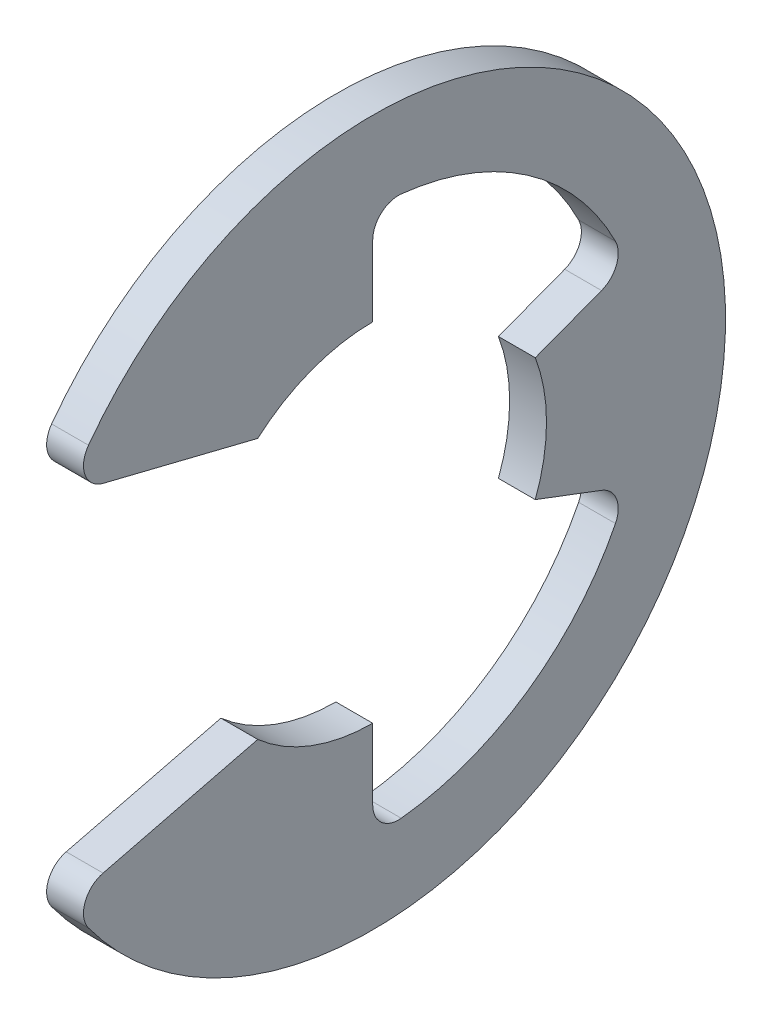
ISO-10303-21;
HEADER;
FILE_DESCRIPTION(('STEP AP214'),'2;1');
FILE_NAME('part.step','',(''),(''),'','','');
FILE_SCHEMA(('AUTOMOTIVE_DESIGN { 1 0 10303 214 1 1 1 1 }'));
ENDSEC;
DATA;
#1=APPLICATION_CONTEXT('core data for automotive mechanical design processes');
#2=APPLICATION_PROTOCOL_DEFINITION('international standard','automotive_design',2000,#1);
#3=PRODUCT_CONTEXT('',#1,'mechanical');
#4=PRODUCT('Part','Part','',(#3));
#5=PRODUCT_RELATED_PRODUCT_CATEGORY('part','',(#4));
#6=PRODUCT_DEFINITION_FORMATION('','',#4);
#7=PRODUCT_DEFINITION_CONTEXT('part definition',#1,'design');
#8=PRODUCT_DEFINITION('design','',#6,#7);
#9=PRODUCT_DEFINITION_SHAPE('','',#8);
#10=(LENGTH_UNIT() NAMED_UNIT(*) SI_UNIT(.MILLI.,.METRE.));
#11=(NAMED_UNIT(*) PLANE_ANGLE_UNIT() SI_UNIT($,.RADIAN.));
#12=(NAMED_UNIT(*) SI_UNIT($,.STERADIAN.) SOLID_ANGLE_UNIT());
#13=UNCERTAINTY_MEASURE_WITH_UNIT(LENGTH_MEASURE(1.E-05),#10,'distance_accuracy_value','');
#14=(GEOMETRIC_REPRESENTATION_CONTEXT(3) GLOBAL_UNCERTAINTY_ASSIGNED_CONTEXT((#13)) GLOBAL_UNIT_ASSIGNED_CONTEXT((#10,
#11,#12)) REPRESENTATION_CONTEXT('',''));
#15=CARTESIAN_POINT('',(0.,0.,0.));
#16=DIRECTION('',(0.,0.,1.));
#17=DIRECTION('',(1.,0.,0.));
#18=AXIS2_PLACEMENT_3D('',#15,#16,#17);
#19=CARTESIAN_POINT('',(-0.5334,0.,0.));
#20=DIRECTION('',(1.,0.,0.));
#21=DIRECTION('',(0.,0.,-1.));
#22=AXIS2_PLACEMENT_3D('',#19,#20,#21);
#23=PLANE('',#22);
#24=CARTESIAN_POINT('',(-0.5334,0.,0.));
#25=DIRECTION('',(-1.,0.,0.));
#26=DIRECTION('',(0.,0.,1.));
#27=AXIS2_PLACEMENT_3D('',#24,#25,#26);
#28=CIRCLE('',#27,10.2108);
#29=CARTESIAN_POINT('',(-0.533400000146,-6.05063164709256,8.22497983652338));
#30=VERTEX_POINT('',#29);
#31=CARTESIAN_POINT('',(-0.5334,6.05063164709256,8.22497983652338));
#32=VERTEX_POINT('',#31);
#33=EDGE_CURVE('E139',#30,#32,#28,.F.);
#34=ORIENTED_EDGE('',*,*,#33,.F.);
#35=CARTESIAN_POINT('',(-0.533400000146,-5.60812276544,7.62345146042));
#36=DIRECTION('',(-1.,0.,0.));
#37=DIRECTION('',(0.,0.,1.));
#38=AXIS2_PLACEMENT_3D('',#35,#36,#37);
#39=CIRCLE('',#38,0.74676);
#40=CARTESIAN_POINT('',(-0.533400000146,-4.88336468230544,7.80338538866378));
#41=VERTEX_POINT('',#40);
#42=EDGE_CURVE('E20',#41,#30,#39,.F.);
#43=ORIENTED_EDGE('',*,*,#42,.F.);
#44=DIRECTION('',(0.,0.24095282060708,-0.970536829925322));
#45=VECTOR('',#44,1.);
#46=CARTESIAN_POINT('',(-0.533400000146,-5.13688856516,8.82455735485));
#47=LINE('',#46,#45);
#48=CARTESIAN_POINT('',(-0.533400000146,-3.77189999999897,3.32650312340268));
#49=VERTEX_POINT('',#48);
#50=EDGE_CURVE('E143',#41,#49,#47,.T.);
#51=ORIENTED_EDGE('',*,*,#50,.T.);
#52=CARTESIAN_POINT('',(-0.533400000146,0.,0.));
#53=DIRECTION('',(-1.,0.,0.));
#54=DIRECTION('',(0.,0.,1.));
#55=AXIS2_PLACEMENT_3D('',#52,#53,#54);
#56=CIRCLE('',#55,5.0292);
#57=CARTESIAN_POINT('',(-0.533400000146,-5.0292,0.));
#58=VERTEX_POINT('',#57);
#59=EDGE_CURVE('E218',#49,#58,#56,.F.);
#60=ORIENTED_EDGE('',*,*,#59,.T.);
#61=DIRECTION('',(0.,-1.,0.));
#62=VECTOR('',#61,1.);
#63=CARTESIAN_POINT('',(-0.533400000146,-5.0292,0.));
#64=LINE('',#63,#62);
#65=CARTESIAN_POINT('',(-0.533400000146,-7.07977202237,0.));
#66=VERTEX_POINT('',#65);
#67=EDGE_CURVE('E165',#58,#66,#64,.T.);
#68=ORIENTED_EDGE('',*,*,#67,.T.);
#69=CARTESIAN_POINT('',(-0.533400000146,-7.07977202194,-0.74676));
#70=DIRECTION('',(-1.,0.,0.));
#71=DIRECTION('',(0.,0.,1.));
#72=AXIS2_PLACEMENT_3D('',#69,#70,#71);
#73=CIRCLE('',#72,0.74676);
#74=CARTESIAN_POINT('',(-0.533400000146,-7.82241228858765,-0.825092189765818));
#75=VERTEX_POINT('',#74);
#76=EDGE_CURVE('E220',#66,#75,#73,.F.);
#77=ORIENTED_EDGE('',*,*,#76,.T.);
#78=CARTESIAN_POINT('',(-0.533400000146,0.,0.));
#79=DIRECTION('',(-1.,0.,0.));
#80=DIRECTION('',(0.,0.,1.));
#81=AXIS2_PLACEMENT_3D('',#78,#79,#80);
#82=CIRCLE('',#81,7.86580645161);
#83=CARTESIAN_POINT('',(-0.533400000146,-3.5374434588992,-7.02548253924918));
#84=VERTEX_POINT('',#83);
#85=EDGE_CURVE('E222',#75,#84,#82,.F.);
#86=ORIENTED_EDGE('',*,*,#85,.T.);
#87=CARTESIAN_POINT('',(-0.533400000146,-3.20160742052,-6.35850079068));
#88=DIRECTION('',(-1.,0.,0.));
#89=DIRECTION('',(0.,0.,1.));
#90=AXIS2_PLACEMENT_3D('',#87,#88,#89);
#91=CIRCLE('',#90,0.74676);
#92=CARTESIAN_POINT('',(-0.533400000073,-2.50307740313384,-6.62252032104072));
#93=VERTEX_POINT('',#92);
#94=EDGE_CURVE('E226',#84,#93,#91,.F.);
#95=ORIENTED_EDGE('',*,*,#94,.T.);
#96=DIRECTION('',(0.,0.353553390593195,0.935414346693515));
#97=VECTOR('',#96,1.);
#98=CARTESIAN_POINT('',(-0.533400000146001,-1.77809071197,-4.70438583239));
#99=LINE('',#98,#97);
#100=CARTESIAN_POINT('',(-0.533400000146,-1.77809071197025,-4.70438583239066));
#101=VERTEX_POINT('',#100);
#102=EDGE_CURVE('E169',#93,#101,#99,.T.);
#103=ORIENTED_EDGE('',*,*,#102,.T.);
#104=CARTESIAN_POINT('',(-0.533400000146,0.,0.));
#105=DIRECTION('',(-1.,0.,0.));
#106=DIRECTION('',(0.,0.,1.));
#107=AXIS2_PLACEMENT_3D('',#104,#105,#106);
#108=CIRCLE('',#107,5.0292);
#109=CARTESIAN_POINT('',(-0.533400000073,1.7780907119705,-4.70438583239133));
#110=VERTEX_POINT('',#109);
#111=EDGE_CURVE('E228',#101,#110,#108,.F.);
#112=ORIENTED_EDGE('',*,*,#111,.T.);
#113=DIRECTION('',(0.,0.353553390593195,-0.935414346693515));
#114=VECTOR('',#113,1.);
#115=CARTESIAN_POINT('',(-0.533400000146001,1.77809071197,-4.70438583239));
#116=LINE('',#115,#114);
#117=CARTESIAN_POINT('',(-0.533400000146,2.50307740313355,-6.62252032104083));
#118=VERTEX_POINT('',#117);
#119=EDGE_CURVE('E174',#110,#118,#116,.T.);
#120=ORIENTED_EDGE('',*,*,#119,.T.);
#121=CARTESIAN_POINT('',(-0.533400000146,3.20160742052,-6.35850079068));
#122=DIRECTION('',(-1.,0.,0.));
#123=DIRECTION('',(0.,0.,1.));
#124=AXIS2_PLACEMENT_3D('',#121,#122,#123);
#125=CIRCLE('',#124,0.74676);
#126=CARTESIAN_POINT('',(-0.533400000065342,3.53744345889961,-7.02548253925));
#127=VERTEX_POINT('',#126);
#128=EDGE_CURVE('E177',#118,#127,#125,.F.);
#129=ORIENTED_EDGE('',*,*,#128,.T.);
#130=CARTESIAN_POINT('',(-0.533400000146,0.,0.));
#131=DIRECTION('',(-1.,0.,0.));
#132=DIRECTION('',(0.,0.,1.));
#133=AXIS2_PLACEMENT_3D('',#130,#131,#132);
#134=CIRCLE('',#133,7.86580645161);
#135=CARTESIAN_POINT('',(-0.533400000146,7.82241228858322,-0.825092189765351));
#136=VERTEX_POINT('',#135);
#137=EDGE_CURVE('E233',#127,#136,#134,.F.);
#138=ORIENTED_EDGE('',*,*,#137,.T.);
#139=CARTESIAN_POINT('',(-0.533400000146,7.07977202194,-0.74676));
#140=DIRECTION('',(-1.,0.,0.));
#141=DIRECTION('',(0.,0.,1.));
#142=AXIS2_PLACEMENT_3D('',#139,#140,#141);
#143=CIRCLE('',#142,0.74676);
#144=CARTESIAN_POINT('',(-0.533400000146,7.07977202194,0.));
#145=VERTEX_POINT('',#144);
#146=EDGE_CURVE('E181',#136,#145,#143,.F.);
#147=ORIENTED_EDGE('',*,*,#146,.T.);
#148=DIRECTION('',(0.,-1.,0.));
#149=VECTOR('',#148,1.);
#150=CARTESIAN_POINT('',(-0.533400000146,5.0292,0.));
#151=LINE('',#150,#149);
#152=CARTESIAN_POINT('',(-0.533400000146,5.0292,0.));
#153=VERTEX_POINT('',#152);
#154=EDGE_CURVE('E178',#145,#153,#151,.T.);
#155=ORIENTED_EDGE('',*,*,#154,.T.);
#156=CARTESIAN_POINT('',(-0.533400000146,0.,0.));
#157=DIRECTION('',(-1.,0.,0.));
#158=DIRECTION('',(0.,0.,1.));
#159=AXIS2_PLACEMENT_3D('',#156,#157,#158);
#160=CIRCLE('',#159,5.0292);
#161=CARTESIAN_POINT('',(-0.533400000146,3.77190000000918,3.3265031233911));
#162=VERTEX_POINT('',#161);
#163=EDGE_CURVE('E238',#153,#162,#160,.F.);
#164=ORIENTED_EDGE('',*,*,#163,.T.);
#165=DIRECTION('',(0.,0.24095282060708,0.970536829925322));
#166=VECTOR('',#165,1.);
#167=CARTESIAN_POINT('',(-0.533400000146,5.13688856516,8.82455735485));
#168=LINE('',#167,#166);
#169=CARTESIAN_POINT('',(-0.533400000146,4.88336468232247,7.80338538873828));
#170=VERTEX_POINT('',#169);
#171=EDGE_CURVE('E183',#162,#170,#168,.T.);
#172=ORIENTED_EDGE('',*,*,#171,.T.);
#173=CARTESIAN_POINT('',(-0.533400000146,5.60812276544,7.62345146042));
#174=DIRECTION('',(-1.,0.,0.));
#175=DIRECTION('',(0.,0.,1.));
#176=AXIS2_PLACEMENT_3D('',#173,#174,#175);
#177=CIRCLE('',#176,0.74676);
#178=EDGE_CURVE('E185',#32,#170,#177,.F.);
#179=ORIENTED_EDGE('',*,*,#178,.F.);
#180=EDGE_LOOP('',(#34,#43,#51,#60,#68,#77,#86,#95,#103,#112,#120,#129,#138,#147,#155,#164,#172,#179));
#181=FACE_BOUND('',#180,.T.);
#182=ADVANCED_FACE('F17',(#181),#23,.F.);
#183=CARTESIAN_POINT('',(0.5334,-5.13688856516,8.82455735485));
#184=DIRECTION('',(0.,-0.970536829925322,-0.24095282060708));
#185=DIRECTION('',(0.,0.24095282060708,-0.970536829925322));
#186=AXIS2_PLACEMENT_3D('',#183,#184,#185);
#187=PLANE('',#186);
#188=DIRECTION('',(-1.,0.,0.));
#189=VECTOR('',#188,1.);
#190=CARTESIAN_POINT('',(0.5334,-4.88336468228867,7.80338538859033));
#191=LINE('',#190,#189);
#192=CARTESIAN_POINT('',(0.5334,-4.88336468230749,7.8033853886633));
#193=VERTEX_POINT('',#192);
#194=EDGE_CURVE('E150',#193,#41,#191,.T.);
#195=ORIENTED_EDGE('',*,*,#194,.F.);
#196=DIRECTION('',(0.,-0.240952820607153,0.970536829925303));
#197=VECTOR('',#196,1.);
#198=CARTESIAN_POINT('',(0.5334,-3.7719,3.3265031234));
#199=LINE('',#198,#197);
#200=CARTESIAN_POINT('',(0.5334,-3.77190000000052,3.32650312340092));
#201=VERTEX_POINT('',#200);
#202=EDGE_CURVE('E217',#201,#193,#199,.T.);
#203=ORIENTED_EDGE('',*,*,#202,.F.);
#204=DIRECTION('',(-1.,0.,0.));
#205=VECTOR('',#204,1.);
#206=CARTESIAN_POINT('',(0.5334,-3.77190000000075,3.32650312340066));
#207=LINE('',#206,#205);
#208=EDGE_CURVE('E155',#201,#49,#207,.T.);
#209=ORIENTED_EDGE('',*,*,#208,.T.);
#210=ORIENTED_EDGE('',*,*,#50,.F.);
#211=EDGE_LOOP('',(#195,#203,#209,#210));
#212=FACE_BOUND('',#211,.T.);
#213=ADVANCED_FACE('F152',(#212),#187,.F.);
#214=CARTESIAN_POINT('',(0.5334,-5.60812276544,7.62345146042));
#215=DIRECTION('',(-1.,0.,0.));
#216=DIRECTION('',(0.,0.,1.));
#217=AXIS2_PLACEMENT_3D('',#214,#215,#216);
#218=CYLINDRICAL_SURFACE('',#217,0.74676);
#219=ORIENTED_EDGE('',*,*,#42,.T.);
#220=DIRECTION('',(-1.,0.,0.));
#221=VECTOR('',#220,1.);
#222=CARTESIAN_POINT('',(0.5334,-6.05063164709211,8.22497983652285));
#223=LINE('',#222,#221);
#224=CARTESIAN_POINT('',(0.5334,-6.05063164709215,8.22497983652282));
#225=VERTEX_POINT('',#224);
#226=EDGE_CURVE('E149',#225,#30,#223,.T.);
#227=ORIENTED_EDGE('',*,*,#226,.F.);
#228=CARTESIAN_POINT('',(0.5334,-5.60812276544,7.62345146042));
#229=DIRECTION('',(-1.,0.,0.));
#230=DIRECTION('',(0.,0.,1.));
#231=AXIS2_PLACEMENT_3D('',#228,#229,#230);
#232=CIRCLE('',#231,0.74676);
#233=EDGE_CURVE('E159',#193,#225,#232,.F.);
#234=ORIENTED_EDGE('',*,*,#233,.F.);
#235=ORIENTED_EDGE('',*,*,#194,.T.);
#236=EDGE_LOOP('',(#219,#227,#234,#235));
#237=FACE_BOUND('',#236,.T.);
#238=ADVANCED_FACE('F158',(#237),#218,.T.);
#239=CARTESIAN_POINT('',(0.5334,0.,0.));
#240=DIRECTION('',(-1.,0.,0.));
#241=DIRECTION('',(0.,0.,1.));
#242=AXIS2_PLACEMENT_3D('',#239,#240,#241);
#243=CYLINDRICAL_SURFACE('',#242,10.2108);
#244=DIRECTION('',(-1.,0.,0.));
#245=VECTOR('',#244,1.);
#246=CARTESIAN_POINT('',(0.5334,6.05063164709292,8.22497983652397));
#247=LINE('',#246,#245);
#248=CARTESIAN_POINT('',(0.5334,6.05063164709297,8.22497983652394));
#249=VERTEX_POINT('',#248);
#250=EDGE_CURVE('E243',#249,#32,#247,.T.);
#251=ORIENTED_EDGE('',*,*,#250,.F.);
#252=CARTESIAN_POINT('',(0.5334,0.,0.));
#253=DIRECTION('',(-1.,0.,0.));
#254=DIRECTION('',(0.,0.,1.));
#255=AXIS2_PLACEMENT_3D('',#252,#253,#254);
#256=CIRCLE('',#255,10.2108);
#257=EDGE_CURVE('E214',#225,#249,#256,.F.);
#258=ORIENTED_EDGE('',*,*,#257,.F.);
#259=ORIENTED_EDGE('',*,*,#226,.T.);
#260=ORIENTED_EDGE('',*,*,#33,.T.);
#261=EDGE_LOOP('',(#251,#258,#259,#260));
#262=FACE_BOUND('',#261,.T.);
#263=ADVANCED_FACE('F248',(#262),#243,.T.);
#264=CARTESIAN_POINT('',(0.5334,5.60812276544,7.62345146042));
#265=DIRECTION('',(-1.,0.,0.));
#266=DIRECTION('',(0.,0.,1.));
#267=AXIS2_PLACEMENT_3D('',#264,#265,#266);
#268=CYLINDRICAL_SURFACE('',#267,0.74676);
#269=ORIENTED_EDGE('',*,*,#178,.T.);
#270=DIRECTION('',(1.,0.,0.));
#271=VECTOR('',#270,1.);
#272=CARTESIAN_POINT('',(0.5334,4.88336468232273,7.80338538873932));
#273=LINE('',#272,#271);
#274=CARTESIAN_POINT('',(0.5334,4.88336468232093,7.80338538873791));
#275=VERTEX_POINT('',#274);
#276=EDGE_CURVE('E184',#170,#275,#273,.T.);
#277=ORIENTED_EDGE('',*,*,#276,.T.);
#278=CARTESIAN_POINT('',(0.5334,5.60812276544,7.62345146042));
#279=DIRECTION('',(-1.,0.,0.));
#280=DIRECTION('',(0.,0.,1.));
#281=AXIS2_PLACEMENT_3D('',#278,#279,#280);
#282=CIRCLE('',#281,0.74676);
#283=EDGE_CURVE('E212',#249,#275,#282,.F.);
#284=ORIENTED_EDGE('',*,*,#283,.F.);
#285=ORIENTED_EDGE('',*,*,#250,.T.);
#286=EDGE_LOOP('',(#269,#277,#284,#285));
#287=FACE_BOUND('',#286,.T.);
#288=ADVANCED_FACE('F279',(#287),#268,.T.);
#289=CARTESIAN_POINT('',(0.5334,5.13688856516,8.82455735485));
#290=DIRECTION('',(0.,0.970536829925322,-0.24095282060708));
#291=DIRECTION('',(0.,0.24095282060708,0.970536829925322));
#292=AXIS2_PLACEMENT_3D('',#289,#290,#291);
#293=PLANE('',#292);
#294=ORIENTED_EDGE('',*,*,#276,.F.);
#295=ORIENTED_EDGE('',*,*,#171,.F.);
#296=DIRECTION('',(-1.,0.,0.));
#297=VECTOR('',#296,1.);
#298=CARTESIAN_POINT('',(0.5334,3.77190000002118,3.3265031233775));
#299=LINE('',#298,#297);
#300=CARTESIAN_POINT('',(0.5334,3.77190000001168,3.32650312338827));
#301=VERTEX_POINT('',#300);
#302=EDGE_CURVE('E241',#162,#301,#299,.F.);
#303=ORIENTED_EDGE('',*,*,#302,.T.);
#304=DIRECTION('',(0.,-0.240952820605182,-0.970536829925793));
#305=VECTOR('',#304,1.);
#306=CARTESIAN_POINT('',(0.5334,4.88336468232,7.80338538874));
#307=LINE('',#306,#305);
#308=EDGE_CURVE('E211',#275,#301,#307,.T.);
#309=ORIENTED_EDGE('',*,*,#308,.F.);
#310=EDGE_LOOP('',(#294,#295,#303,#309));
#311=FACE_BOUND('',#310,.T.);
#312=ADVANCED_FACE('F281',(#311),#293,.F.);
#313=CARTESIAN_POINT('',(0.5334,0.,0.));
#314=DIRECTION('',(-1.,0.,0.));
#315=DIRECTION('',(0.,0.,1.));
#316=AXIS2_PLACEMENT_3D('',#313,#314,#315);
#317=CYLINDRICAL_SURFACE('',#316,5.0292);
#318=DIRECTION('',(1.,0.,0.));
#319=VECTOR('',#318,1.);
#320=CARTESIAN_POINT('',(0.5334,5.0292,0.));
#321=LINE('',#320,#319);
#322=CARTESIAN_POINT('',(0.5334,5.0292,0.));
#323=VERTEX_POINT('',#322);
#324=EDGE_CURVE('E182',#153,#323,#321,.T.);
#325=ORIENTED_EDGE('',*,*,#324,.T.);
#326=CARTESIAN_POINT('',(0.5334,0.,0.));
#327=DIRECTION('',(-1.,0.,0.));
#328=DIRECTION('',(0.,0.,1.));
#329=AXIS2_PLACEMENT_3D('',#326,#327,#328);
#330=CIRCLE('',#329,5.0292);
#331=EDGE_CURVE('E208',#301,#323,#330,.T.);
#332=ORIENTED_EDGE('',*,*,#331,.F.);
#333=ORIENTED_EDGE('',*,*,#302,.F.);
#334=ORIENTED_EDGE('',*,*,#163,.F.);
#335=EDGE_LOOP('',(#325,#332,#333,#334));
#336=FACE_BOUND('',#335,.T.);
#337=ADVANCED_FACE('F287',(#336),#317,.F.);
#338=CARTESIAN_POINT('',(0.5334,5.0292,0.));
#339=DIRECTION('',(0.,0.,1.));
#340=DIRECTION('',(0.,-1.,0.));
#341=AXIS2_PLACEMENT_3D('',#338,#339,#340);
#342=PLANE('',#341);
#343=DIRECTION('',(-1.,0.,0.));
#344=VECTOR('',#343,1.);
#345=CARTESIAN_POINT('',(0.5334,7.07977202194,0.));
#346=LINE('',#345,#344);
#347=CARTESIAN_POINT('',(0.5334,7.07977202194,0.));
#348=VERTEX_POINT('',#347);
#349=EDGE_CURVE('E236',#145,#348,#346,.F.);
#350=ORIENTED_EDGE('',*,*,#349,.T.);
#351=DIRECTION('',(0.,1.,0.));
#352=VECTOR('',#351,1.);
#353=CARTESIAN_POINT('',(0.5334,0.,0.));
#354=LINE('',#353,#352);
#355=EDGE_CURVE('E207',#323,#348,#354,.T.);
#356=ORIENTED_EDGE('',*,*,#355,.F.);
#357=ORIENTED_EDGE('',*,*,#324,.F.);
#358=ORIENTED_EDGE('',*,*,#154,.F.);
#359=EDGE_LOOP('',(#350,#356,#357,#358));
#360=FACE_BOUND('',#359,.T.);
#361=ADVANCED_FACE('F291',(#360),#342,.F.);
#362=CARTESIAN_POINT('',(0.5334,7.07977202194,-0.74676));
#363=DIRECTION('',(-1.,0.,0.));
#364=DIRECTION('',(0.,0.,1.));
#365=AXIS2_PLACEMENT_3D('',#362,#363,#364);
#366=CYLINDRICAL_SURFACE('',#365,0.74676);
#367=ORIENTED_EDGE('',*,*,#349,.F.);
#368=ORIENTED_EDGE('',*,*,#146,.F.);
#369=DIRECTION('',(-1.,0.,0.));
#370=VECTOR('',#369,1.);
#371=CARTESIAN_POINT('',(0.5334,7.82241228858322,-0.825092189765286));
#372=LINE('',#371,#370);
#373=CARTESIAN_POINT('',(0.5334,7.82241228858322,-0.825092189765351));
#374=VERTEX_POINT('',#373);
#375=EDGE_CURVE('E235',#136,#374,#372,.F.);
#376=ORIENTED_EDGE('',*,*,#375,.T.);
#377=CARTESIAN_POINT('',(0.5334,7.07977202194,-0.74676));
#378=DIRECTION('',(-1.,0.,0.));
#379=DIRECTION('',(0.,0.,1.));
#380=AXIS2_PLACEMENT_3D('',#377,#378,#379);
#381=CIRCLE('',#380,0.74676);
#382=EDGE_CURVE('E204',#348,#374,#381,.T.);
#383=ORIENTED_EDGE('',*,*,#382,.F.);
#384=EDGE_LOOP('',(#367,#368,#376,#383));
#385=FACE_BOUND('',#384,.T.);
#386=ADVANCED_FACE('F341',(#385),#366,.F.);
#387=CARTESIAN_POINT('',(0.5334,0.,0.));
#388=DIRECTION('',(-1.,0.,0.));
#389=DIRECTION('',(0.,0.,1.));
#390=AXIS2_PLACEMENT_3D('',#387,#388,#389);
#391=CYLINDRICAL_SURFACE('',#390,7.86580645161);
#392=ORIENTED_EDGE('',*,*,#375,.F.);
#393=ORIENTED_EDGE('',*,*,#137,.F.);
#394=DIRECTION('',(-1.,0.,0.));
#395=VECTOR('',#394,1.);
#396=CARTESIAN_POINT('',(0.5334,3.53744345889992,-7.02548253924984));
#397=LINE('',#396,#395);
#398=CARTESIAN_POINT('',(0.5334,3.53744345889961,-7.02548253925));
#399=VERTEX_POINT('',#398);
#400=EDGE_CURVE('E232',#127,#399,#397,.F.);
#401=ORIENTED_EDGE('',*,*,#400,.T.);
#402=CARTESIAN_POINT('',(0.5334,0.,0.));
#403=DIRECTION('',(-1.,0.,0.));
#404=DIRECTION('',(0.,0.,1.));
#405=AXIS2_PLACEMENT_3D('',#402,#403,#404);
#406=CIRCLE('',#405,7.86580645161);
#407=EDGE_CURVE('E201',#374,#399,#406,.T.);
#408=ORIENTED_EDGE('',*,*,#407,.F.);
#409=EDGE_LOOP('',(#392,#393,#401,#408));
#410=FACE_BOUND('',#409,.T.);
#411=ADVANCED_FACE('F338',(#410),#391,.F.);
#412=CARTESIAN_POINT('',(0.5334,3.20160742052,-6.35850079068));
#413=DIRECTION('',(-1.,0.,0.));
#414=DIRECTION('',(0.,0.,1.));
#415=AXIS2_PLACEMENT_3D('',#412,#413,#414);
#416=CYLINDRICAL_SURFACE('',#415,0.74676);
#417=DIRECTION('',(1.,0.,0.));
#418=VECTOR('',#417,1.);
#419=CARTESIAN_POINT('',(0.5334,2.50307740328512,-6.62252032144184));
#420=LINE('',#419,#418);
#421=CARTESIAN_POINT('',(0.5334,2.50307740313633,-6.6225203210408));
#422=VERTEX_POINT('',#421);
#423=EDGE_CURVE('E176',#118,#422,#420,.T.);
#424=ORIENTED_EDGE('',*,*,#423,.T.);
#425=CARTESIAN_POINT('',(0.5334,3.20160742052,-6.35850079068));
#426=DIRECTION('',(-1.,0.,0.));
#427=DIRECTION('',(0.,0.,1.));
#428=AXIS2_PLACEMENT_3D('',#425,#426,#427);
#429=CIRCLE('',#428,0.74676);
#430=EDGE_CURVE('E199',#399,#422,#429,.T.);
#431=ORIENTED_EDGE('',*,*,#430,.F.);
#432=ORIENTED_EDGE('',*,*,#400,.F.);
#433=ORIENTED_EDGE('',*,*,#128,.F.);
#434=EDGE_LOOP('',(#424,#431,#432,#433));
#435=FACE_BOUND('',#434,.T.);
#436=ADVANCED_FACE('F332',(#435),#416,.F.);
#437=CARTESIAN_POINT('',(0.5334,1.77809071197,-4.70438583239));
#438=DIRECTION('',(0.,-0.935414346693515,-0.353553390593195));
#439=DIRECTION('',(0.,0.353553390593195,-0.935414346693515));
#440=AXIS2_PLACEMENT_3D('',#437,#438,#439);
#441=PLANE('',#440);
#442=ORIENTED_EDGE('',*,*,#423,.F.);
#443=ORIENTED_EDGE('',*,*,#119,.F.);
#444=DIRECTION('',(-1.,0.,0.));
#445=VECTOR('',#444,1.);
#446=CARTESIAN_POINT('',(0.5334,1.7780907119705,-4.70438583239133));
#447=LINE('',#446,#445);
#448=CARTESIAN_POINT('',(0.5334,1.7780907119705,-4.70438583239133));
#449=VERTEX_POINT('',#448);
#450=EDGE_CURVE('E230',#110,#449,#447,.F.);
#451=ORIENTED_EDGE('',*,*,#450,.T.);
#452=DIRECTION('',(0.,-0.353553390595575,0.935414346692615));
#453=VECTOR('',#452,1.);
#454=CARTESIAN_POINT('',(0.5334,2.50307740329,-6.62252032144));
#455=LINE('',#454,#453);
#456=EDGE_CURVE('E198',#422,#449,#455,.T.);
#457=ORIENTED_EDGE('',*,*,#456,.F.);
#458=EDGE_LOOP('',(#442,#443,#451,#457));
#459=FACE_BOUND('',#458,.T.);
#460=ADVANCED_FACE('F328',(#459),#441,.F.);
#461=CARTESIAN_POINT('',(0.5334,0.,0.));
#462=DIRECTION('',(-1.,0.,0.));
#463=DIRECTION('',(0.,0.,1.));
#464=AXIS2_PLACEMENT_3D('',#461,#462,#463);
#465=CYLINDRICAL_SURFACE('',#464,5.0292);
#466=DIRECTION('',(1.,0.,0.));
#467=VECTOR('',#466,1.);
#468=CARTESIAN_POINT('',(0.5334,-1.77809071197,-4.70438583239));
#469=LINE('',#468,#467);
#470=CARTESIAN_POINT('',(0.5334,-1.77809071197025,-4.70438583239066));
#471=VERTEX_POINT('',#470);
#472=EDGE_CURVE('E173',#101,#471,#469,.T.);
#473=ORIENTED_EDGE('',*,*,#472,.T.);
#474=CARTESIAN_POINT('',(0.5334,0.,0.));
#475=DIRECTION('',(-1.,0.,0.));
#476=DIRECTION('',(0.,0.,1.));
#477=AXIS2_PLACEMENT_3D('',#474,#475,#476);
#478=CIRCLE('',#477,5.0292);
#479=EDGE_CURVE('E196',#449,#471,#478,.T.);
#480=ORIENTED_EDGE('',*,*,#479,.F.);
#481=ORIENTED_EDGE('',*,*,#450,.F.);
#482=ORIENTED_EDGE('',*,*,#111,.F.);
#483=EDGE_LOOP('',(#473,#480,#481,#482));
#484=FACE_BOUND('',#483,.T.);
#485=ADVANCED_FACE('F322',(#484),#465,.F.);
#486=CARTESIAN_POINT('',(0.5334,-1.77809071197,-4.70438583239));
#487=DIRECTION('',(0.,0.935414346693515,-0.353553390593195));
#488=DIRECTION('',(0.,0.353553390593195,0.935414346693515));
#489=AXIS2_PLACEMENT_3D('',#486,#487,#488);
#490=PLANE('',#489);
#491=DIRECTION('',(-1.,0.,0.));
#492=VECTOR('',#491,1.);
#493=CARTESIAN_POINT('',(0.5334,-2.50307740328629,-6.6225203214414));
#494=LINE('',#493,#492);
#495=CARTESIAN_POINT('',(0.5334,-2.50307740313691,-6.62252032104058));
#496=VERTEX_POINT('',#495);
#497=EDGE_CURVE('E172',#93,#496,#494,.F.);
#498=ORIENTED_EDGE('',*,*,#497,.T.);
#499=DIRECTION('',(0.,-0.353553390595575,-0.935414346692615));
#500=VECTOR('',#499,1.);
#501=CARTESIAN_POINT('',(0.5334,-1.77809071197,-4.70438583239));
#502=LINE('',#501,#500);
#503=EDGE_CURVE('E195',#471,#496,#502,.T.);
#504=ORIENTED_EDGE('',*,*,#503,.F.);
#505=ORIENTED_EDGE('',*,*,#472,.F.);
#506=ORIENTED_EDGE('',*,*,#102,.F.);
#507=EDGE_LOOP('',(#498,#504,#505,#506));
#508=FACE_BOUND('',#507,.T.);
#509=ADVANCED_FACE('F318',(#508),#490,.F.);
#510=CARTESIAN_POINT('',(0.5334,-3.20160742052,-6.35850079068));
#511=DIRECTION('',(-1.,0.,0.));
#512=DIRECTION('',(0.,0.,1.));
#513=AXIS2_PLACEMENT_3D('',#510,#511,#512);
#514=CYLINDRICAL_SURFACE('',#513,0.74676);
#515=DIRECTION('',(-1.,0.,0.));
#516=VECTOR('',#515,1.);
#517=CARTESIAN_POINT('',(0.5334,-3.5374434588991,-7.02548253924821));
#518=LINE('',#517,#516);
#519=CARTESIAN_POINT('',(0.5334,-3.53744345889879,-7.02548253924837));
#520=VERTEX_POINT('',#519);
#521=EDGE_CURVE('E225',#84,#520,#518,.F.);
#522=ORIENTED_EDGE('',*,*,#521,.T.);
#523=CARTESIAN_POINT('',(0.5334,-3.20160742052,-6.35850079068));
#524=DIRECTION('',(-1.,0.,0.));
#525=DIRECTION('',(0.,0.,1.));
#526=AXIS2_PLACEMENT_3D('',#523,#524,#525);
#527=CIRCLE('',#526,0.74676);
#528=EDGE_CURVE('E193',#496,#520,#527,.T.);
#529=ORIENTED_EDGE('',*,*,#528,.F.);
#530=ORIENTED_EDGE('',*,*,#497,.F.);
#531=ORIENTED_EDGE('',*,*,#94,.F.);
#532=EDGE_LOOP('',(#522,#529,#530,#531));
#533=FACE_BOUND('',#532,.T.);
#534=ADVANCED_FACE('F313',(#533),#514,.F.);
#535=CARTESIAN_POINT('',(0.5334,0.,0.));
#536=DIRECTION('',(-1.,0.,0.));
#537=DIRECTION('',(0.,0.,1.));
#538=AXIS2_PLACEMENT_3D('',#535,#536,#537);
#539=CYLINDRICAL_SURFACE('',#538,7.86580645161);
#540=DIRECTION('',(-1.,0.,0.));
#541=VECTOR('',#540,1.);
#542=CARTESIAN_POINT('',(0.5334,-7.82241228858766,-0.825092189765753));
#543=LINE('',#542,#541);
#544=CARTESIAN_POINT('',(0.5334,-7.82241228858765,-0.825092189765818));
#545=VERTEX_POINT('',#544);
#546=EDGE_CURVE('E168',#75,#545,#543,.F.);
#547=ORIENTED_EDGE('',*,*,#546,.T.);
#548=CARTESIAN_POINT('',(0.5334,0.,0.));
#549=DIRECTION('',(-1.,0.,0.));
#550=DIRECTION('',(0.,0.,1.));
#551=AXIS2_PLACEMENT_3D('',#548,#549,#550);
#552=CIRCLE('',#551,7.86580645161);
#553=EDGE_CURVE('E190',#520,#545,#552,.T.);
#554=ORIENTED_EDGE('',*,*,#553,.F.);
#555=ORIENTED_EDGE('',*,*,#521,.F.);
#556=ORIENTED_EDGE('',*,*,#85,.F.);
#557=EDGE_LOOP('',(#547,#554,#555,#556));
#558=FACE_BOUND('',#557,.T.);
#559=ADVANCED_FACE('F309',(#558),#539,.F.);
#560=CARTESIAN_POINT('',(0.5334,-7.07977202194,-0.74676));
#561=DIRECTION('',(-1.,0.,0.));
#562=DIRECTION('',(0.,0.,1.));
#563=AXIS2_PLACEMENT_3D('',#560,#561,#562);
#564=CYLINDRICAL_SURFACE('',#563,0.74676);
#565=ORIENTED_EDGE('',*,*,#546,.F.);
#566=ORIENTED_EDGE('',*,*,#76,.F.);
#567=DIRECTION('',(1.,0.,0.));
#568=VECTOR('',#567,1.);
#569=CARTESIAN_POINT('',(0.5334,-7.0797720228,0.));
#570=LINE('',#569,#568);
#571=CARTESIAN_POINT('',(0.5334,-7.07977202237,0.));
#572=VERTEX_POINT('',#571);
#573=EDGE_CURVE('E167',#66,#572,#570,.T.);
#574=ORIENTED_EDGE('',*,*,#573,.T.);
#575=CARTESIAN_POINT('',(0.5334,-7.07977202194,-0.74676));
#576=DIRECTION('',(-1.,0.,0.));
#577=DIRECTION('',(0.,0.,1.));
#578=AXIS2_PLACEMENT_3D('',#575,#576,#577);
#579=CIRCLE('',#578,0.74676);
#580=EDGE_CURVE('E187',#545,#572,#579,.T.);
#581=ORIENTED_EDGE('',*,*,#580,.F.);
#582=EDGE_LOOP('',(#565,#566,#574,#581));
#583=FACE_BOUND('',#582,.T.);
#584=ADVANCED_FACE('F305',(#583),#564,.F.);
#585=CARTESIAN_POINT('',(0.5334,-5.0292,0.));
#586=DIRECTION('',(0.,0.,1.));
#587=DIRECTION('',(0.,-1.,0.));
#588=AXIS2_PLACEMENT_3D('',#585,#586,#587);
#589=PLANE('',#588);
#590=ORIENTED_EDGE('',*,*,#573,.F.);
#591=ORIENTED_EDGE('',*,*,#67,.F.);
#592=DIRECTION('',(-1.,0.,0.));
#593=VECTOR('',#592,1.);
#594=CARTESIAN_POINT('',(0.5334,-5.0292,0.));
#595=LINE('',#594,#593);
#596=CARTESIAN_POINT('',(0.5334,-5.0292,0.));
#597=VERTEX_POINT('',#596);
#598=EDGE_CURVE('E35',#58,#597,#595,.F.);
#599=ORIENTED_EDGE('',*,*,#598,.T.);
#600=DIRECTION('',(0.,1.,0.));
#601=VECTOR('',#600,1.);
#602=CARTESIAN_POINT('',(0.5334,0.,0.));
#603=LINE('',#602,#601);
#604=EDGE_CURVE('E26',#572,#597,#603,.T.);
#605=ORIENTED_EDGE('',*,*,#604,.F.);
#606=EDGE_LOOP('',(#590,#591,#599,#605));
#607=FACE_BOUND('',#606,.T.);
#608=ADVANCED_FACE('F301',(#607),#589,.F.);
#609=CARTESIAN_POINT('',(0.5334,0.,0.));
#610=DIRECTION('',(-1.,0.,0.));
#611=DIRECTION('',(0.,0.,1.));
#612=AXIS2_PLACEMENT_3D('',#609,#610,#611);
#613=CYLINDRICAL_SURFACE('',#612,5.0292);
#614=ORIENTED_EDGE('',*,*,#208,.F.);
#615=CARTESIAN_POINT('',(0.5334,0.,0.));
#616=DIRECTION('',(-1.,0.,0.));
#617=DIRECTION('',(0.,0.,1.));
#618=AXIS2_PLACEMENT_3D('',#615,#616,#617);
#619=CIRCLE('',#618,5.0292);
#620=EDGE_CURVE('E11',#597,#201,#619,.T.);
#621=ORIENTED_EDGE('',*,*,#620,.F.);
#622=ORIENTED_EDGE('',*,*,#598,.F.);
#623=ORIENTED_EDGE('',*,*,#59,.F.);
#624=EDGE_LOOP('',(#614,#621,#622,#623));
#625=FACE_BOUND('',#624,.T.);
#626=ADVANCED_FACE('F352',(#625),#613,.F.);
#627=CARTESIAN_POINT('',(0.5334,0.,0.));
#628=DIRECTION('',(1.,0.,0.));
#629=DIRECTION('',(0.,0.,-1.));
#630=AXIS2_PLACEMENT_3D('',#627,#628,#629);
#631=PLANE('',#630);
#632=ORIENTED_EDGE('',*,*,#604,.T.);
#633=ORIENTED_EDGE('',*,*,#620,.T.);
#634=ORIENTED_EDGE('',*,*,#202,.T.);
#635=ORIENTED_EDGE('',*,*,#233,.T.);
#636=ORIENTED_EDGE('',*,*,#257,.T.);
#637=ORIENTED_EDGE('',*,*,#283,.T.);
#638=ORIENTED_EDGE('',*,*,#308,.T.);
#639=ORIENTED_EDGE('',*,*,#331,.T.);
#640=ORIENTED_EDGE('',*,*,#355,.T.);
#641=ORIENTED_EDGE('',*,*,#382,.T.);
#642=ORIENTED_EDGE('',*,*,#407,.T.);
#643=ORIENTED_EDGE('',*,*,#430,.T.);
#644=ORIENTED_EDGE('',*,*,#456,.T.);
#645=ORIENTED_EDGE('',*,*,#479,.T.);
#646=ORIENTED_EDGE('',*,*,#503,.T.);
#647=ORIENTED_EDGE('',*,*,#528,.T.);
#648=ORIENTED_EDGE('',*,*,#553,.T.);
#649=ORIENTED_EDGE('',*,*,#580,.T.);
#650=EDGE_LOOP('',(#632,#633,#634,#635,#636,#637,#638,#639,#640,#641,#642,#643,#644,#645,#646,
#647,#648,#649));
#651=FACE_BOUND('',#650,.T.);
#652=ADVANCED_FACE('F252',(#651),#631,.T.);
#653=CLOSED_SHELL('',(#182,#213,#238,#263,#288,#312,#337,#361,#386,#411,#436,#460,#485,#509,
#534,#559,#584,#608,#626,#652));
#654=MANIFOLD_SOLID_BREP('B1',#653);
#655=ADVANCED_BREP_SHAPE_REPRESENTATION('',(#18,#654),#14);
#656=SHAPE_DEFINITION_REPRESENTATION(#9,#655);
ENDSEC;
END-ISO-10303-21;
